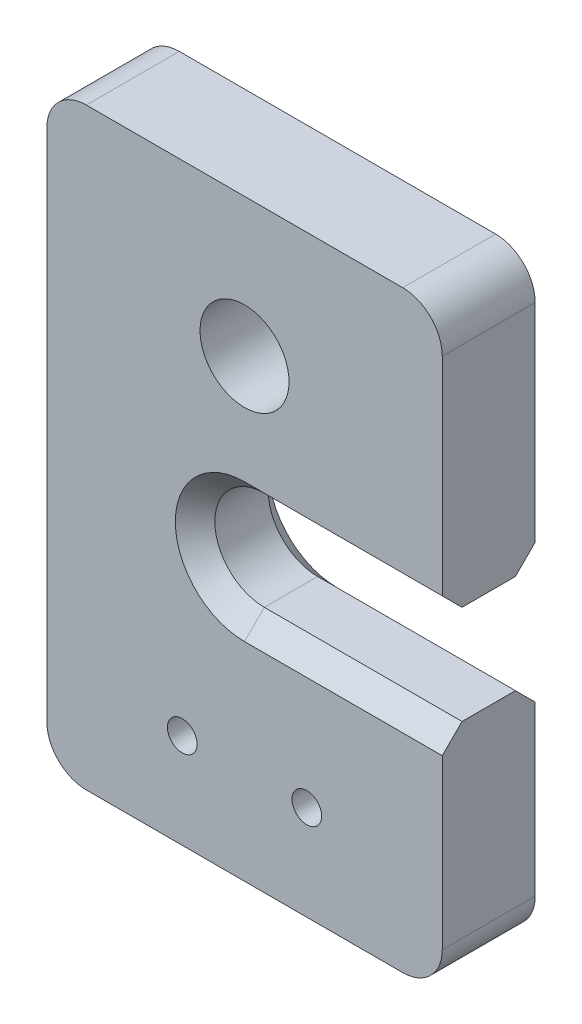
ISO-10303-21;
HEADER;
FILE_DESCRIPTION(('STEP AP214'),'2;1');
FILE_NAME('part.step','',(''),(''),'','','');
FILE_SCHEMA(('AUTOMOTIVE_DESIGN { 1 0 10303 214 1 1 1 1 }'));
ENDSEC;
DATA;
#1=APPLICATION_CONTEXT('core data for automotive mechanical design processes');
#2=APPLICATION_PROTOCOL_DEFINITION('international standard','automotive_design',2000,#1);
#3=PRODUCT_CONTEXT('',#1,'mechanical');
#4=PRODUCT('Part','Part','',(#3));
#5=PRODUCT_RELATED_PRODUCT_CATEGORY('part','',(#4));
#6=PRODUCT_DEFINITION_FORMATION('','',#4);
#7=PRODUCT_DEFINITION_CONTEXT('part definition',#1,'design');
#8=PRODUCT_DEFINITION('design','',#6,#7);
#9=PRODUCT_DEFINITION_SHAPE('','',#8);
#10=(LENGTH_UNIT() NAMED_UNIT(*) SI_UNIT(.MILLI.,.METRE.));
#11=(NAMED_UNIT(*) PLANE_ANGLE_UNIT() SI_UNIT($,.RADIAN.));
#12=(NAMED_UNIT(*) SI_UNIT($,.STERADIAN.) SOLID_ANGLE_UNIT());
#13=UNCERTAINTY_MEASURE_WITH_UNIT(LENGTH_MEASURE(1.E-05),#10,'distance_accuracy_value','');
#14=(GEOMETRIC_REPRESENTATION_CONTEXT(3) GLOBAL_UNCERTAINTY_ASSIGNED_CONTEXT((#13)) GLOBAL_UNIT_ASSIGNED_CONTEXT((#10,
#11,#12)) REPRESENTATION_CONTEXT('',''));
#15=CARTESIAN_POINT('',(0.,0.,0.));
#16=DIRECTION('',(0.,0.,1.));
#17=DIRECTION('',(1.,0.,0.));
#18=AXIS2_PLACEMENT_3D('',#15,#16,#17);
#19=CARTESIAN_POINT('',(20.,2.00000000000001,4.7));
#20=DIRECTION('',(-1.,0.,0.));
#21=DIRECTION('',(0.,0.,1.));
#22=AXIS2_PLACEMENT_3D('',#19,#20,#21);
#23=PLANE('',#22);
#24=DIRECTION('',(0.,1.,0.));
#25=VECTOR('',#24,1.);
#26=CARTESIAN_POINT('',(20.,2.00000000000001,0.));
#27=LINE('',#26,#25);
#28=CARTESIAN_POINT('',(20.,2.00000000000001,0.));
#29=VERTEX_POINT('',#28);
#30=CARTESIAN_POINT('',(20.,10.5,0.));
#31=VERTEX_POINT('',#30);
#32=EDGE_CURVE('E245',#29,#31,#27,.T.);
#33=ORIENTED_EDGE('',*,*,#32,.T.);
#34=DIRECTION('',(0.,-0.707106781186545,-0.70710678118655));
#35=VECTOR('',#34,1.);
#36=CARTESIAN_POINT('',(20.,10.5,0.));
#37=LINE('',#36,#35);
#38=CARTESIAN_POINT('',(20.,11.5,1.00000000000001));
#39=VERTEX_POINT('',#38);
#40=EDGE_CURVE('E194',#31,#39,#37,.F.);
#41=ORIENTED_EDGE('',*,*,#40,.T.);
#42=DIRECTION('',(0.,0.,1.));
#43=VECTOR('',#42,1.);
#44=CARTESIAN_POINT('',(20.,11.5,0.));
#45=LINE('',#44,#43);
#46=CARTESIAN_POINT('',(20.,11.5,3.7));
#47=VERTEX_POINT('',#46);
#48=EDGE_CURVE('E511',#39,#47,#45,.T.);
#49=ORIENTED_EDGE('',*,*,#48,.T.);
#50=DIRECTION('',(0.,-0.707106781186549,0.707106781186546));
#51=VECTOR('',#50,1.);
#52=CARTESIAN_POINT('',(20.,11.5,3.7));
#53=LINE('',#52,#51);
#54=CARTESIAN_POINT('',(20.,10.5,4.7));
#55=VERTEX_POINT('',#54);
#56=EDGE_CURVE('E149',#47,#55,#53,.T.);
#57=ORIENTED_EDGE('',*,*,#56,.T.);
#58=DIRECTION('',(0.,1.,0.));
#59=VECTOR('',#58,1.);
#60=CARTESIAN_POINT('',(20.,2.00000000000001,4.7));
#61=LINE('',#60,#59);
#62=CARTESIAN_POINT('',(20.,2.00000000000001,4.7));
#63=VERTEX_POINT('',#62);
#64=EDGE_CURVE('E142',#63,#55,#61,.T.);
#65=ORIENTED_EDGE('',*,*,#64,.F.);
#66=DIRECTION('',(0.,0.,-1.));
#67=VECTOR('',#66,1.);
#68=CARTESIAN_POINT('',(20.,2.00000000000001,4.7));
#69=LINE('',#68,#67);
#70=EDGE_CURVE('E146',#63,#29,#69,.T.);
#71=ORIENTED_EDGE('',*,*,#70,.T.);
#72=EDGE_LOOP('',(#33,#41,#49,#57,#65,#71));
#73=FACE_BOUND('',#72,.T.);
#74=ADVANCED_FACE('F32',(#73),#23,.F.);
#75=CARTESIAN_POINT('',(18.,2.,4.7));
#76=DIRECTION('',(0.,0.,1.));
#77=DIRECTION('',(1.,0.,0.));
#78=AXIS2_PLACEMENT_3D('',#75,#76,#77);
#79=PLANE('',#78);
#80=ORIENTED_EDGE('',*,*,#64,.T.);
#81=DIRECTION('',(-1.,0.,0.));
#82=VECTOR('',#81,1.);
#83=CARTESIAN_POINT('',(10.,10.5,4.7));
#84=LINE('',#83,#82);
#85=CARTESIAN_POINT('',(10.,10.5,4.7));
#86=VERTEX_POINT('',#85);
#87=EDGE_CURVE('E11',#55,#86,#84,.T.);
#88=ORIENTED_EDGE('',*,*,#87,.T.);
#89=CARTESIAN_POINT('',(10.,14.,4.7));
#90=DIRECTION('',(0.,0.,1.));
#91=DIRECTION('',(1.,0.,0.));
#92=AXIS2_PLACEMENT_3D('',#89,#90,#91);
#93=CIRCLE('',#92,3.50000000000001);
#94=CARTESIAN_POINT('',(10.,17.5,4.7));
#95=VERTEX_POINT('',#94);
#96=EDGE_CURVE('E41',#86,#95,#93,.F.);
#97=ORIENTED_EDGE('',*,*,#96,.T.);
#98=DIRECTION('',(1.,0.,0.));
#99=VECTOR('',#98,1.);
#100=CARTESIAN_POINT('',(20.,17.5,4.7));
#101=LINE('',#100,#99);
#102=CARTESIAN_POINT('',(20.,17.5,4.7));
#103=VERTEX_POINT('',#102);
#104=EDGE_CURVE('E201',#95,#103,#101,.T.);
#105=ORIENTED_EDGE('',*,*,#104,.T.);
#106=CARTESIAN_POINT('',(20.,28.,4.7));
#107=VERTEX_POINT('',#106);
#108=EDGE_CURVE('E151',#103,#107,#61,.T.);
#109=ORIENTED_EDGE('',*,*,#108,.T.);
#110=CARTESIAN_POINT('',(18.,28.,4.7));
#111=DIRECTION('',(0.,0.,1.));
#112=DIRECTION('',(1.,0.,0.));
#113=AXIS2_PLACEMENT_3D('',#110,#111,#112);
#114=CIRCLE('',#113,2.);
#115=CARTESIAN_POINT('',(18.,30.,4.7));
#116=VERTEX_POINT('',#115);
#117=EDGE_CURVE('E150',#107,#116,#114,.T.);
#118=ORIENTED_EDGE('',*,*,#117,.T.);
#119=DIRECTION('',(-1.,0.,0.));
#120=VECTOR('',#119,1.);
#121=CARTESIAN_POINT('',(2.00000000000001,30.,4.7));
#122=LINE('',#121,#120);
#123=CARTESIAN_POINT('',(2.00000000000001,30.,4.7));
#124=VERTEX_POINT('',#123);
#125=EDGE_CURVE('E232',#116,#124,#122,.T.);
#126=ORIENTED_EDGE('',*,*,#125,.T.);
#127=CARTESIAN_POINT('',(2.,28.,4.7));
#128=DIRECTION('',(0.,0.,1.));
#129=DIRECTION('',(1.,0.,0.));
#130=AXIS2_PLACEMENT_3D('',#127,#128,#129);
#131=CIRCLE('',#130,2.);
#132=CARTESIAN_POINT('',(0.,28.,4.7));
#133=VERTEX_POINT('',#132);
#134=EDGE_CURVE('E234',#124,#133,#131,.T.);
#135=ORIENTED_EDGE('',*,*,#134,.T.);
#136=DIRECTION('',(0.,-1.,0.));
#137=VECTOR('',#136,1.);
#138=CARTESIAN_POINT('',(0.,2.00000000000001,4.7));
#139=LINE('',#138,#137);
#140=CARTESIAN_POINT('',(0.,2.00000000000001,4.7));
#141=VERTEX_POINT('',#140);
#142=EDGE_CURVE('E236',#133,#141,#139,.T.);
#143=ORIENTED_EDGE('',*,*,#142,.T.);
#144=CARTESIAN_POINT('',(2.,2.,4.7));
#145=DIRECTION('',(0.,0.,1.));
#146=DIRECTION('',(1.,0.,0.));
#147=AXIS2_PLACEMENT_3D('',#144,#145,#146);
#148=CIRCLE('',#147,2.);
#149=CARTESIAN_POINT('',(2.00000000000001,0.,4.7));
#150=VERTEX_POINT('',#149);
#151=EDGE_CURVE('E238',#141,#150,#148,.T.);
#152=ORIENTED_EDGE('',*,*,#151,.T.);
#153=DIRECTION('',(1.,0.,0.));
#154=VECTOR('',#153,1.);
#155=CARTESIAN_POINT('',(2.00000000000001,0.,4.7));
#156=LINE('',#155,#154);
#157=CARTESIAN_POINT('',(18.,0.,4.7));
#158=VERTEX_POINT('',#157);
#159=EDGE_CURVE('E158',#150,#158,#156,.T.);
#160=ORIENTED_EDGE('',*,*,#159,.T.);
#161=CARTESIAN_POINT('',(18.,2.,4.7));
#162=DIRECTION('',(0.,0.,1.));
#163=DIRECTION('',(1.,0.,0.));
#164=AXIS2_PLACEMENT_3D('',#161,#162,#163);
#165=CIRCLE('',#164,2.);
#166=EDGE_CURVE('E154',#158,#63,#165,.T.);
#167=ORIENTED_EDGE('',*,*,#166,.T.);
#168=EDGE_LOOP('',(#80,#88,#97,#105,#109,#118,#126,#135,#143,#152,#160,#167));
#169=FACE_BOUND('',#168,.T.);
#170=CARTESIAN_POINT('',(6.85,4.8,4.7));
#171=DIRECTION('',(0.,0.,1.));
#172=DIRECTION('',(1.,0.,0.));
#173=AXIS2_PLACEMENT_3D('',#170,#171,#172);
#174=CIRCLE('',#173,0.75);
#175=CARTESIAN_POINT('',(7.6,4.8,4.7));
#176=VERTEX_POINT('',#175);
#177=EDGE_CURVE('E527',#176,#176,#174,.T.);
#178=ORIENTED_EDGE('',*,*,#177,.F.);
#179=EDGE_LOOP('',(#178));
#180=FACE_BOUND('',#179,.T.);
#181=CARTESIAN_POINT('',(10.,23.,4.7));
#182=DIRECTION('',(0.,0.,1.));
#183=DIRECTION('',(1.,0.,0.));
#184=AXIS2_PLACEMENT_3D('',#181,#182,#183);
#185=CIRCLE('',#184,2.25);
#186=CARTESIAN_POINT('',(12.25,23.,4.7));
#187=VERTEX_POINT('',#186);
#188=EDGE_CURVE('E244',#187,#187,#185,.T.);
#189=ORIENTED_EDGE('',*,*,#188,.F.);
#190=EDGE_LOOP('',(#189));
#191=FACE_BOUND('',#190,.T.);
#192=CARTESIAN_POINT('',(13.15,4.8,4.7));
#193=DIRECTION('',(0.,0.,1.));
#194=DIRECTION('',(1.,0.,0.));
#195=AXIS2_PLACEMENT_3D('',#192,#193,#194);
#196=CIRCLE('',#195,0.750000000000002);
#197=CARTESIAN_POINT('',(13.9,4.8,4.7));
#198=VERTEX_POINT('',#197);
#199=EDGE_CURVE('E521',#198,#198,#196,.T.);
#200=ORIENTED_EDGE('',*,*,#199,.F.);
#201=EDGE_LOOP('',(#200));
#202=FACE_BOUND('',#201,.T.);
#203=ADVANCED_FACE('F155',(#169,#180,#191,#202),#79,.T.);
#204=CARTESIAN_POINT('',(18.,2.,0.));
#205=DIRECTION('',(0.,0.,1.));
#206=DIRECTION('',(1.,0.,0.));
#207=AXIS2_PLACEMENT_3D('',#204,#205,#206);
#208=PLANE('',#207);
#209=CARTESIAN_POINT('',(20.,17.5,0.));
#210=VERTEX_POINT('',#209);
#211=CARTESIAN_POINT('',(20.,28.,0.));
#212=VERTEX_POINT('',#211);
#213=EDGE_CURVE('E243',#210,#212,#27,.T.);
#214=ORIENTED_EDGE('',*,*,#213,.F.);
#215=DIRECTION('',(-1.,0.,0.));
#216=VECTOR('',#215,1.);
#217=CARTESIAN_POINT('',(18.,17.5,0.));
#218=LINE('',#217,#216);
#219=CARTESIAN_POINT('',(10.,17.5,0.));
#220=VERTEX_POINT('',#219);
#221=EDGE_CURVE('E178',#210,#220,#218,.T.);
#222=ORIENTED_EDGE('',*,*,#221,.T.);
#223=CARTESIAN_POINT('',(10.,14.,0.));
#224=DIRECTION('',(0.,0.,1.));
#225=DIRECTION('',(1.,0.,0.));
#226=AXIS2_PLACEMENT_3D('',#223,#224,#225);
#227=CIRCLE('',#226,3.50000000000001);
#228=CARTESIAN_POINT('',(10.,10.5,0.));
#229=VERTEX_POINT('',#228);
#230=EDGE_CURVE('E170',#220,#229,#227,.T.);
#231=ORIENTED_EDGE('',*,*,#230,.T.);
#232=DIRECTION('',(1.,0.,0.));
#233=VECTOR('',#232,1.);
#234=CARTESIAN_POINT('',(18.,10.5,0.));
#235=LINE('',#234,#233);
#236=EDGE_CURVE('E167',#229,#31,#235,.T.);
#237=ORIENTED_EDGE('',*,*,#236,.T.);
#238=ORIENTED_EDGE('',*,*,#32,.F.);
#239=CARTESIAN_POINT('',(18.,2.,0.));
#240=DIRECTION('',(0.,0.,1.));
#241=DIRECTION('',(1.,0.,0.));
#242=AXIS2_PLACEMENT_3D('',#239,#240,#241);
#243=CIRCLE('',#242,2.);
#244=CARTESIAN_POINT('',(18.,0.,0.));
#245=VERTEX_POINT('',#244);
#246=EDGE_CURVE('E166',#245,#29,#243,.T.);
#247=ORIENTED_EDGE('',*,*,#246,.F.);
#248=DIRECTION('',(1.,0.,0.));
#249=VECTOR('',#248,1.);
#250=CARTESIAN_POINT('',(2.00000000000001,0.,0.));
#251=LINE('',#250,#249);
#252=CARTESIAN_POINT('',(2.00000000000001,0.,0.));
#253=VERTEX_POINT('',#252);
#254=EDGE_CURVE('E162',#253,#245,#251,.T.);
#255=ORIENTED_EDGE('',*,*,#254,.F.);
#256=CARTESIAN_POINT('',(2.,2.,0.));
#257=DIRECTION('',(0.,0.,1.));
#258=DIRECTION('',(1.,0.,0.));
#259=AXIS2_PLACEMENT_3D('',#256,#257,#258);
#260=CIRCLE('',#259,2.);
#261=CARTESIAN_POINT('',(0.,2.00000000000001,0.));
#262=VERTEX_POINT('',#261);
#263=EDGE_CURVE('E255',#262,#253,#260,.T.);
#264=ORIENTED_EDGE('',*,*,#263,.F.);
#265=DIRECTION('',(0.,-1.,0.));
#266=VECTOR('',#265,1.);
#267=CARTESIAN_POINT('',(0.,2.00000000000001,0.));
#268=LINE('',#267,#266);
#269=CARTESIAN_POINT('',(0.,28.,0.));
#270=VERTEX_POINT('',#269);
#271=EDGE_CURVE('E253',#270,#262,#268,.T.);
#272=ORIENTED_EDGE('',*,*,#271,.F.);
#273=CARTESIAN_POINT('',(2.,28.,0.));
#274=DIRECTION('',(0.,0.,1.));
#275=DIRECTION('',(1.,0.,0.));
#276=AXIS2_PLACEMENT_3D('',#273,#274,#275);
#277=CIRCLE('',#276,2.);
#278=CARTESIAN_POINT('',(2.00000000000001,30.,0.));
#279=VERTEX_POINT('',#278);
#280=EDGE_CURVE('E251',#279,#270,#277,.T.);
#281=ORIENTED_EDGE('',*,*,#280,.F.);
#282=DIRECTION('',(-1.,0.,0.));
#283=VECTOR('',#282,1.);
#284=CARTESIAN_POINT('',(2.00000000000001,30.,0.));
#285=LINE('',#284,#283);
#286=CARTESIAN_POINT('',(18.,30.,0.));
#287=VERTEX_POINT('',#286);
#288=EDGE_CURVE('E249',#287,#279,#285,.T.);
#289=ORIENTED_EDGE('',*,*,#288,.F.);
#290=CARTESIAN_POINT('',(18.,28.,0.));
#291=DIRECTION('',(0.,0.,1.));
#292=DIRECTION('',(1.,0.,0.));
#293=AXIS2_PLACEMENT_3D('',#290,#291,#292);
#294=CIRCLE('',#293,2.);
#295=EDGE_CURVE('E247',#212,#287,#294,.T.);
#296=ORIENTED_EDGE('',*,*,#295,.F.);
#297=EDGE_LOOP('',(#214,#222,#231,#237,#238,#247,#255,#264,#272,#281,#289,#296));
#298=FACE_BOUND('',#297,.T.);
#299=CARTESIAN_POINT('',(10.,23.,0.));
#300=DIRECTION('',(0.,0.,1.));
#301=DIRECTION('',(1.,0.,0.));
#302=AXIS2_PLACEMENT_3D('',#299,#300,#301);
#303=CIRCLE('',#302,2.25);
#304=CARTESIAN_POINT('',(12.25,23.,0.));
#305=VERTEX_POINT('',#304);
#306=EDGE_CURVE('E530',#305,#305,#303,.T.);
#307=ORIENTED_EDGE('',*,*,#306,.T.);
#308=EDGE_LOOP('',(#307));
#309=FACE_BOUND('',#308,.T.);
#310=CARTESIAN_POINT('',(6.85,4.8,0.));
#311=DIRECTION('',(0.,0.,1.));
#312=DIRECTION('',(1.,0.,0.));
#313=AXIS2_PLACEMENT_3D('',#310,#311,#312);
#314=CIRCLE('',#313,0.75);
#315=CARTESIAN_POINT('',(7.6,4.8,0.));
#316=VERTEX_POINT('',#315);
#317=EDGE_CURVE('E524',#316,#316,#314,.T.);
#318=ORIENTED_EDGE('',*,*,#317,.T.);
#319=EDGE_LOOP('',(#318));
#320=FACE_BOUND('',#319,.T.);
#321=CARTESIAN_POINT('',(13.15,4.8,0.));
#322=DIRECTION('',(0.,0.,1.));
#323=DIRECTION('',(1.,0.,0.));
#324=AXIS2_PLACEMENT_3D('',#321,#322,#323);
#325=CIRCLE('',#324,0.750000000000002);
#326=CARTESIAN_POINT('',(13.9,4.8,0.));
#327=VERTEX_POINT('',#326);
#328=EDGE_CURVE('E516',#327,#327,#325,.T.);
#329=ORIENTED_EDGE('',*,*,#328,.T.);
#330=EDGE_LOOP('',(#329));
#331=FACE_BOUND('',#330,.T.);
#332=ADVANCED_FACE('F282',(#298,#309,#320,#331),#208,.F.);
#333=CARTESIAN_POINT('',(18.,2.,4.7));
#334=DIRECTION('',(0.,0.,-1.));
#335=DIRECTION('',(-1.,0.,0.));
#336=AXIS2_PLACEMENT_3D('',#333,#334,#335);
#337=CYLINDRICAL_SURFACE('',#336,2.);
#338=ORIENTED_EDGE('',*,*,#246,.T.);
#339=ORIENTED_EDGE('',*,*,#70,.F.);
#340=ORIENTED_EDGE('',*,*,#166,.F.);
#341=DIRECTION('',(0.,0.,-1.));
#342=VECTOR('',#341,1.);
#343=CARTESIAN_POINT('',(18.,0.,4.7));
#344=LINE('',#343,#342);
#345=EDGE_CURVE('E241',#158,#245,#344,.T.);
#346=ORIENTED_EDGE('',*,*,#345,.T.);
#347=EDGE_LOOP('',(#338,#339,#340,#346));
#348=FACE_BOUND('',#347,.T.);
#349=ADVANCED_FACE('F164',(#348),#337,.T.);
#350=DIRECTION('',(0.,0.,1.));
#351=VECTOR('',#350,1.);
#352=CARTESIAN_POINT('',(20.,16.5,0.));
#353=LINE('',#352,#351);
#354=CARTESIAN_POINT('',(20.,16.5,1.00000000000001));
#355=VERTEX_POINT('',#354);
#356=CARTESIAN_POINT('',(20.,16.5,3.7));
#357=VERTEX_POINT('',#356);
#358=EDGE_CURVE('E208',#355,#357,#353,.T.);
#359=ORIENTED_EDGE('',*,*,#358,.F.);
#360=DIRECTION('',(0.,-0.707106781186545,0.70710678118655));
#361=VECTOR('',#360,1.);
#362=CARTESIAN_POINT('',(20.,17.5,0.));
#363=LINE('',#362,#361);
#364=EDGE_CURVE('E187',#355,#210,#363,.F.);
#365=ORIENTED_EDGE('',*,*,#364,.T.);
#366=ORIENTED_EDGE('',*,*,#213,.T.);
#367=DIRECTION('',(0.,0.,-1.));
#368=VECTOR('',#367,1.);
#369=CARTESIAN_POINT('',(20.,28.,4.7));
#370=LINE('',#369,#368);
#371=EDGE_CURVE('E168',#107,#212,#370,.T.);
#372=ORIENTED_EDGE('',*,*,#371,.F.);
#373=ORIENTED_EDGE('',*,*,#108,.F.);
#374=DIRECTION('',(0.,-0.707106781186549,-0.707106781186547));
#375=VECTOR('',#374,1.);
#376=CARTESIAN_POINT('',(20.,16.5,3.7));
#377=LINE('',#376,#375);
#378=EDGE_CURVE('E185',#103,#357,#377,.T.);
#379=ORIENTED_EDGE('',*,*,#378,.T.);
#380=EDGE_LOOP('',(#359,#365,#366,#372,#373,#379));
#381=FACE_BOUND('',#380,.T.);
#382=ADVANCED_FACE('F226',(#381),#23,.F.);
#383=CARTESIAN_POINT('',(18.,28.,4.7));
#384=DIRECTION('',(0.,0.,-1.));
#385=DIRECTION('',(-1.,0.,0.));
#386=AXIS2_PLACEMENT_3D('',#383,#384,#385);
#387=CYLINDRICAL_SURFACE('',#386,2.);
#388=ORIENTED_EDGE('',*,*,#295,.T.);
#389=DIRECTION('',(0.,0.,-1.));
#390=VECTOR('',#389,1.);
#391=CARTESIAN_POINT('',(18.,30.,4.7));
#392=LINE('',#391,#390);
#393=EDGE_CURVE('E173',#116,#287,#392,.T.);
#394=ORIENTED_EDGE('',*,*,#393,.F.);
#395=ORIENTED_EDGE('',*,*,#117,.F.);
#396=ORIENTED_EDGE('',*,*,#371,.T.);
#397=EDGE_LOOP('',(#388,#394,#395,#396));
#398=FACE_BOUND('',#397,.T.);
#399=ADVANCED_FACE('F296',(#398),#387,.T.);
#400=CARTESIAN_POINT('',(2.00000000000001,30.,4.7));
#401=DIRECTION('',(0.,-1.,0.));
#402=DIRECTION('',(0.,0.,-1.));
#403=AXIS2_PLACEMENT_3D('',#400,#401,#402);
#404=PLANE('',#403);
#405=ORIENTED_EDGE('',*,*,#288,.T.);
#406=DIRECTION('',(0.,0.,-1.));
#407=VECTOR('',#406,1.);
#408=CARTESIAN_POINT('',(2.00000000000001,30.,4.7));
#409=LINE('',#408,#407);
#410=EDGE_CURVE('E268',#124,#279,#409,.T.);
#411=ORIENTED_EDGE('',*,*,#410,.F.);
#412=ORIENTED_EDGE('',*,*,#125,.F.);
#413=ORIENTED_EDGE('',*,*,#393,.T.);
#414=EDGE_LOOP('',(#405,#411,#412,#413));
#415=FACE_BOUND('',#414,.T.);
#416=ADVANCED_FACE('F275',(#415),#404,.F.);
#417=CARTESIAN_POINT('',(2.,28.,4.7));
#418=DIRECTION('',(0.,0.,-1.));
#419=DIRECTION('',(-1.,0.,0.));
#420=AXIS2_PLACEMENT_3D('',#417,#418,#419);
#421=CYLINDRICAL_SURFACE('',#420,2.);
#422=ORIENTED_EDGE('',*,*,#280,.T.);
#423=DIRECTION('',(0.,0.,-1.));
#424=VECTOR('',#423,1.);
#425=CARTESIAN_POINT('',(0.,28.,4.7));
#426=LINE('',#425,#424);
#427=EDGE_CURVE('E265',#133,#270,#426,.T.);
#428=ORIENTED_EDGE('',*,*,#427,.F.);
#429=ORIENTED_EDGE('',*,*,#134,.F.);
#430=ORIENTED_EDGE('',*,*,#410,.T.);
#431=EDGE_LOOP('',(#422,#428,#429,#430));
#432=FACE_BOUND('',#431,.T.);
#433=ADVANCED_FACE('F288',(#432),#421,.T.);
#434=CARTESIAN_POINT('',(0.,2.00000000000001,4.7));
#435=DIRECTION('',(1.,0.,0.));
#436=DIRECTION('',(0.,0.,-1.));
#437=AXIS2_PLACEMENT_3D('',#434,#435,#436);
#438=PLANE('',#437);
#439=ORIENTED_EDGE('',*,*,#271,.T.);
#440=DIRECTION('',(0.,0.,-1.));
#441=VECTOR('',#440,1.);
#442=CARTESIAN_POINT('',(0.,2.00000000000001,4.7));
#443=LINE('',#442,#441);
#444=EDGE_CURVE('E262',#141,#262,#443,.T.);
#445=ORIENTED_EDGE('',*,*,#444,.F.);
#446=ORIENTED_EDGE('',*,*,#142,.F.);
#447=ORIENTED_EDGE('',*,*,#427,.T.);
#448=EDGE_LOOP('',(#439,#445,#446,#447));
#449=FACE_BOUND('',#448,.T.);
#450=ADVANCED_FACE('F292',(#449),#438,.F.);
#451=CARTESIAN_POINT('',(2.,2.,4.7));
#452=DIRECTION('',(0.,0.,-1.));
#453=DIRECTION('',(-1.,0.,0.));
#454=AXIS2_PLACEMENT_3D('',#451,#452,#453);
#455=CYLINDRICAL_SURFACE('',#454,2.);
#456=ORIENTED_EDGE('',*,*,#263,.T.);
#457=DIRECTION('',(0.,0.,-1.));
#458=VECTOR('',#457,1.);
#459=CARTESIAN_POINT('',(2.00000000000001,0.,4.7));
#460=LINE('',#459,#458);
#461=EDGE_CURVE('E259',#150,#253,#460,.T.);
#462=ORIENTED_EDGE('',*,*,#461,.F.);
#463=ORIENTED_EDGE('',*,*,#151,.F.);
#464=ORIENTED_EDGE('',*,*,#444,.T.);
#465=EDGE_LOOP('',(#456,#462,#463,#464));
#466=FACE_BOUND('',#465,.T.);
#467=ADVANCED_FACE('F401',(#466),#455,.T.);
#468=CARTESIAN_POINT('',(2.00000000000001,0.,4.7));
#469=DIRECTION('',(0.,1.,0.));
#470=DIRECTION('',(0.,0.,1.));
#471=AXIS2_PLACEMENT_3D('',#468,#469,#470);
#472=PLANE('',#471);
#473=ORIENTED_EDGE('',*,*,#254,.T.);
#474=ORIENTED_EDGE('',*,*,#345,.F.);
#475=ORIENTED_EDGE('',*,*,#159,.F.);
#476=ORIENTED_EDGE('',*,*,#461,.T.);
#477=EDGE_LOOP('',(#473,#474,#475,#476));
#478=FACE_BOUND('',#477,.T.);
#479=ADVANCED_FACE('F393',(#478),#472,.F.);
#480=CARTESIAN_POINT('',(10.,23.,4.7));
#481=DIRECTION('',(0.,0.,-1.));
#482=DIRECTION('',(-1.,0.,0.));
#483=AXIS2_PLACEMENT_3D('',#480,#481,#482);
#484=CYLINDRICAL_SURFACE('',#483,2.25);
#485=ORIENTED_EDGE('',*,*,#188,.T.);
#486=EDGE_LOOP('',(#485));
#487=FACE_BOUND('',#486,.T.);
#488=ORIENTED_EDGE('',*,*,#306,.F.);
#489=EDGE_LOOP('',(#488));
#490=FACE_BOUND('',#489,.T.);
#491=ADVANCED_FACE('F385',(#487,#490),#484,.F.);
#492=CARTESIAN_POINT('',(6.85,4.8,4.7));
#493=DIRECTION('',(0.,0.,-1.));
#494=DIRECTION('',(-1.,0.,0.));
#495=AXIS2_PLACEMENT_3D('',#492,#493,#494);
#496=CYLINDRICAL_SURFACE('',#495,0.75);
#497=ORIENTED_EDGE('',*,*,#177,.T.);
#498=EDGE_LOOP('',(#497));
#499=FACE_BOUND('',#498,.T.);
#500=ORIENTED_EDGE('',*,*,#317,.F.);
#501=EDGE_LOOP('',(#500));
#502=FACE_BOUND('',#501,.T.);
#503=ADVANCED_FACE('F377',(#499,#502),#496,.F.);
#504=CARTESIAN_POINT('',(13.15,4.8,4.7));
#505=DIRECTION('',(0.,0.,-1.));
#506=DIRECTION('',(-1.,0.,0.));
#507=AXIS2_PLACEMENT_3D('',#504,#505,#506);
#508=CYLINDRICAL_SURFACE('',#507,0.750000000000002);
#509=ORIENTED_EDGE('',*,*,#199,.T.);
#510=EDGE_LOOP('',(#509));
#511=FACE_BOUND('',#510,.T.);
#512=ORIENTED_EDGE('',*,*,#328,.F.);
#513=EDGE_LOOP('',(#512));
#514=FACE_BOUND('',#513,.T.);
#515=ADVANCED_FACE('F368',(#511,#514),#508,.F.);
#516=CARTESIAN_POINT('',(20.,11.5,0.));
#517=DIRECTION('',(0.,-1.,0.));
#518=DIRECTION('',(1.,0.,0.));
#519=AXIS2_PLACEMENT_3D('',#516,#517,#518);
#520=PLANE('',#519);
#521=ORIENTED_EDGE('',*,*,#48,.F.);
#522=DIRECTION('',(-1.,0.,0.));
#523=VECTOR('',#522,1.);
#524=CARTESIAN_POINT('',(20.,11.5,1.00000000000001));
#525=LINE('',#524,#523);
#526=CARTESIAN_POINT('',(10.,11.5,1.00000000000001));
#527=VERTEX_POINT('',#526);
#528=EDGE_CURVE('E199',#39,#527,#525,.T.);
#529=ORIENTED_EDGE('',*,*,#528,.T.);
#530=DIRECTION('',(0.,0.,1.));
#531=VECTOR('',#530,1.);
#532=CARTESIAN_POINT('',(10.,11.5,0.));
#533=LINE('',#532,#531);
#534=CARTESIAN_POINT('',(10.,11.5,3.7));
#535=VERTEX_POINT('',#534);
#536=EDGE_CURVE('E510',#527,#535,#533,.T.);
#537=ORIENTED_EDGE('',*,*,#536,.T.);
#538=DIRECTION('',(1.,0.,0.));
#539=VECTOR('',#538,1.);
#540=CARTESIAN_POINT('',(20.,11.5,3.7));
#541=LINE('',#540,#539);
#542=EDGE_CURVE('E196',#535,#47,#541,.T.);
#543=ORIENTED_EDGE('',*,*,#542,.T.);
#544=EDGE_LOOP('',(#521,#529,#537,#543));
#545=FACE_BOUND('',#544,.T.);
#546=ADVANCED_FACE('F360',(#545),#520,.F.);
#547=CARTESIAN_POINT('',(10.,14.,0.));
#548=DIRECTION('',(0.,0.,1.));
#549=DIRECTION('',(1.,0.,0.));
#550=AXIS2_PLACEMENT_3D('',#547,#548,#549);
#551=CYLINDRICAL_SURFACE('',#550,2.5);
#552=ORIENTED_EDGE('',*,*,#536,.F.);
#553=CARTESIAN_POINT('',(10.,14.,1.00000000000001));
#554=DIRECTION('',(0.,0.,1.));
#555=DIRECTION('',(1.,0.,0.));
#556=AXIS2_PLACEMENT_3D('',#553,#554,#555);
#557=CIRCLE('',#556,2.5);
#558=CARTESIAN_POINT('',(10.,16.5,1.00000000000001));
#559=VERTEX_POINT('',#558);
#560=EDGE_CURVE('E191',#527,#559,#557,.F.);
#561=ORIENTED_EDGE('',*,*,#560,.T.);
#562=DIRECTION('',(0.,0.,1.));
#563=VECTOR('',#562,1.);
#564=CARTESIAN_POINT('',(10.,16.5,0.));
#565=LINE('',#564,#563);
#566=CARTESIAN_POINT('',(10.,16.5,3.7));
#567=VERTEX_POINT('',#566);
#568=EDGE_CURVE('E514',#559,#567,#565,.T.);
#569=ORIENTED_EDGE('',*,*,#568,.T.);
#570=CARTESIAN_POINT('',(10.,14.,3.7));
#571=DIRECTION('',(0.,0.,1.));
#572=DIRECTION('',(1.,0.,0.));
#573=AXIS2_PLACEMENT_3D('',#570,#571,#572);
#574=CIRCLE('',#573,2.5);
#575=EDGE_CURVE('E189',#567,#535,#574,.T.);
#576=ORIENTED_EDGE('',*,*,#575,.T.);
#577=EDGE_LOOP('',(#552,#561,#569,#576));
#578=FACE_BOUND('',#577,.T.);
#579=ADVANCED_FACE('F352',(#578),#551,.F.);
#580=CARTESIAN_POINT('',(20.,16.5,0.));
#581=DIRECTION('',(0.,1.,0.));
#582=DIRECTION('',(-1.,0.,0.));
#583=AXIS2_PLACEMENT_3D('',#580,#581,#582);
#584=PLANE('',#583);
#585=ORIENTED_EDGE('',*,*,#568,.F.);
#586=DIRECTION('',(1.,0.,0.));
#587=VECTOR('',#586,1.);
#588=CARTESIAN_POINT('',(20.,16.5,1.00000000000001));
#589=LINE('',#588,#587);
#590=EDGE_CURVE('E183',#559,#355,#589,.T.);
#591=ORIENTED_EDGE('',*,*,#590,.T.);
#592=ORIENTED_EDGE('',*,*,#358,.T.);
#593=DIRECTION('',(-1.,0.,0.));
#594=VECTOR('',#593,1.);
#595=CARTESIAN_POINT('',(10.,16.5,3.7));
#596=LINE('',#595,#594);
#597=EDGE_CURVE('E181',#357,#567,#596,.T.);
#598=ORIENTED_EDGE('',*,*,#597,.T.);
#599=EDGE_LOOP('',(#585,#591,#592,#598));
#600=FACE_BOUND('',#599,.T.);
#601=ADVANCED_FACE('F324',(#600),#584,.F.);
#602=CARTESIAN_POINT('',(18.,10.5,0.));
#603=DIRECTION('',(0.,-0.70710678118655,0.707106781186545));
#604=DIRECTION('',(1.,0.,0.));
#605=AXIS2_PLACEMENT_3D('',#602,#603,#604);
#606=PLANE('',#605);
#607=ORIENTED_EDGE('',*,*,#40,.F.);
#608=ORIENTED_EDGE('',*,*,#236,.F.);
#609=DIRECTION('',(0.,-0.707106781186545,-0.70710678118655));
#610=VECTOR('',#609,1.);
#611=CARTESIAN_POINT('',(10.,11.5,1.00000000000001));
#612=LINE('',#611,#610);
#613=EDGE_CURVE('E206',#527,#229,#612,.T.);
#614=ORIENTED_EDGE('',*,*,#613,.F.);
#615=ORIENTED_EDGE('',*,*,#528,.F.);
#616=EDGE_LOOP('',(#607,#608,#614,#615));
#617=FACE_BOUND('',#616,.T.);
#618=ADVANCED_FACE('F320',(#617),#606,.F.);
#619=CARTESIAN_POINT('',(10.,14.,0.));
#620=DIRECTION('',(0.,0.,-1.));
#621=DIRECTION('',(-1.,0.,0.));
#622=AXIS2_PLACEMENT_3D('',#619,#620,#621);
#623=CONICAL_SURFACE('',#622,3.50000000000001,0.785398163397445);
#624=ORIENTED_EDGE('',*,*,#613,.T.);
#625=ORIENTED_EDGE('',*,*,#230,.F.);
#626=DIRECTION('',(0.,0.707106781186545,-0.70710678118655));
#627=VECTOR('',#626,1.);
#628=CARTESIAN_POINT('',(10.,16.5,1.00000000000001));
#629=LINE('',#628,#627);
#630=EDGE_CURVE('E204',#559,#220,#629,.T.);
#631=ORIENTED_EDGE('',*,*,#630,.F.);
#632=ORIENTED_EDGE('',*,*,#560,.F.);
#633=EDGE_LOOP('',(#624,#625,#631,#632));
#634=FACE_BOUND('',#633,.T.);
#635=ADVANCED_FACE('F316',(#634),#623,.F.);
#636=CARTESIAN_POINT('',(18.,17.5,0.));
#637=DIRECTION('',(0.,0.70710678118655,0.707106781186545));
#638=DIRECTION('',(-1.,0.,0.));
#639=AXIS2_PLACEMENT_3D('',#636,#637,#638);
#640=PLANE('',#639);
#641=ORIENTED_EDGE('',*,*,#364,.F.);
#642=ORIENTED_EDGE('',*,*,#590,.F.);
#643=ORIENTED_EDGE('',*,*,#630,.T.);
#644=ORIENTED_EDGE('',*,*,#221,.F.);
#645=EDGE_LOOP('',(#641,#642,#643,#644));
#646=FACE_BOUND('',#645,.T.);
#647=ADVANCED_FACE('F313',(#646),#640,.F.);
#648=CARTESIAN_POINT('',(20.,16.5,3.7));
#649=DIRECTION('',(0.,-0.707106781186547,0.707106781186549));
#650=DIRECTION('',(1.,0.,0.));
#651=AXIS2_PLACEMENT_3D('',#648,#649,#650);
#652=PLANE('',#651);
#653=ORIENTED_EDGE('',*,*,#378,.F.);
#654=ORIENTED_EDGE('',*,*,#104,.F.);
#655=DIRECTION('',(0.,0.707106781186549,0.707106781186546));
#656=VECTOR('',#655,1.);
#657=CARTESIAN_POINT('',(10.,16.5,3.7));
#658=LINE('',#657,#656);
#659=EDGE_CURVE('E36',#567,#95,#658,.T.);
#660=ORIENTED_EDGE('',*,*,#659,.F.);
#661=ORIENTED_EDGE('',*,*,#597,.F.);
#662=EDGE_LOOP('',(#653,#654,#660,#661));
#663=FACE_BOUND('',#662,.T.);
#664=ADVANCED_FACE('F34',(#663),#652,.T.);
#665=CARTESIAN_POINT('',(10.,14.,3.7));
#666=DIRECTION('',(0.,0.,1.));
#667=DIRECTION('',(1.,0.,0.));
#668=AXIS2_PLACEMENT_3D('',#665,#666,#667);
#669=CONICAL_SURFACE('',#668,2.5,0.78539816339745);
#670=ORIENTED_EDGE('',*,*,#659,.T.);
#671=ORIENTED_EDGE('',*,*,#96,.F.);
#672=DIRECTION('',(0.,-0.707106781186549,0.707106781186546));
#673=VECTOR('',#672,1.);
#674=CARTESIAN_POINT('',(10.,11.5,3.7));
#675=LINE('',#674,#673);
#676=EDGE_CURVE('E209',#535,#86,#675,.T.);
#677=ORIENTED_EDGE('',*,*,#676,.F.);
#678=ORIENTED_EDGE('',*,*,#575,.F.);
#679=EDGE_LOOP('',(#670,#671,#677,#678));
#680=FACE_BOUND('',#679,.T.);
#681=ADVANCED_FACE('F218',(#680),#669,.F.);
#682=CARTESIAN_POINT('',(20.,11.5,3.7));
#683=DIRECTION('',(0.,0.707106781186547,0.707106781186549));
#684=DIRECTION('',(-1.,0.,0.));
#685=AXIS2_PLACEMENT_3D('',#682,#683,#684);
#686=PLANE('',#685);
#687=ORIENTED_EDGE('',*,*,#676,.T.);
#688=ORIENTED_EDGE('',*,*,#87,.F.);
#689=ORIENTED_EDGE('',*,*,#56,.F.);
#690=ORIENTED_EDGE('',*,*,#542,.F.);
#691=EDGE_LOOP('',(#687,#688,#689,#690));
#692=FACE_BOUND('',#691,.T.);
#693=ADVANCED_FACE('F326',(#692),#686,.T.);
#694=CLOSED_SHELL('',(#74,#203,#332,#349,#382,#399,#416,#433,#450,#467,#479,#491,#503,#515,#546,
#579,#601,#618,#635,#647,#664,#681,#693));
#695=MANIFOLD_SOLID_BREP('B2',#694);
#696=ADVANCED_BREP_SHAPE_REPRESENTATION('',(#18,#695),#14);
#697=SHAPE_DEFINITION_REPRESENTATION(#9,#696);
ENDSEC;
END-ISO-10303-21;
